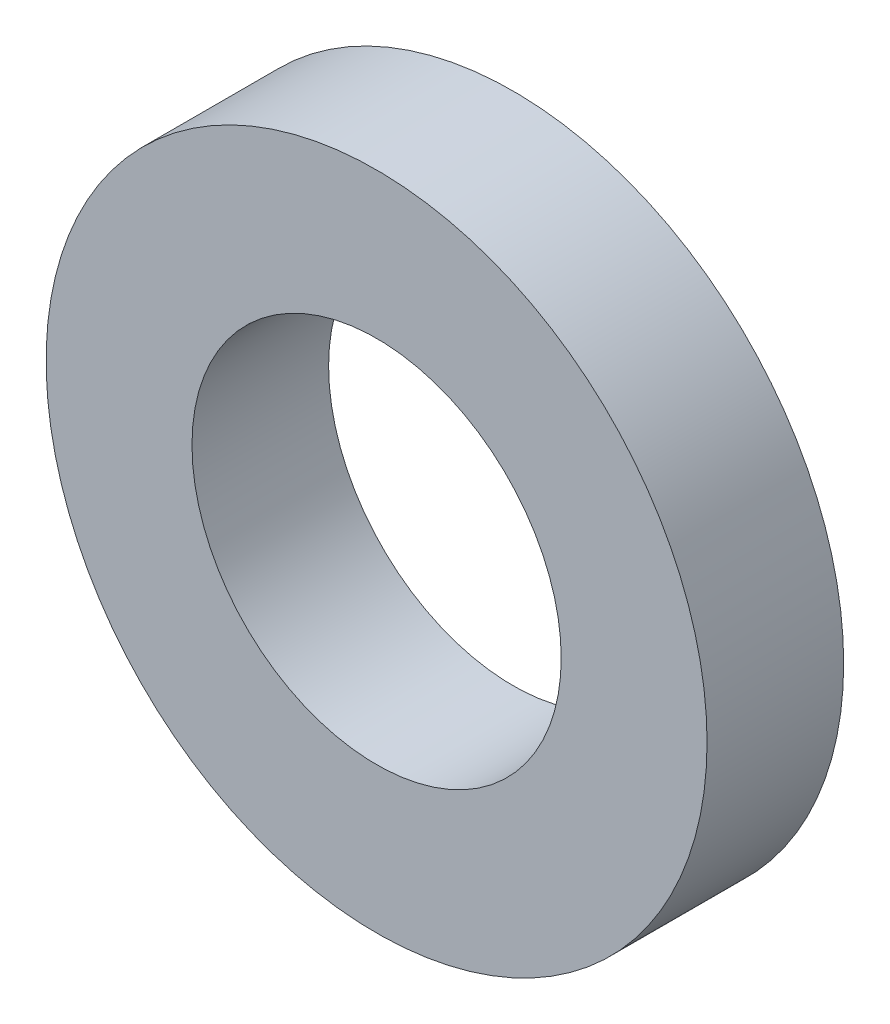
ISO-10303-21;
HEADER;
FILE_DESCRIPTION(('STEP AP214'),'2;1');
FILE_NAME('part.step','',(''),(''),'','','');
FILE_SCHEMA(('AUTOMOTIVE_DESIGN { 1 0 10303 214 1 1 1 1 }'));
ENDSEC;
DATA;
#1=APPLICATION_CONTEXT('core data for automotive mechanical design processes');
#2=APPLICATION_PROTOCOL_DEFINITION('international standard','automotive_design',2000,#1);
#3=PRODUCT_CONTEXT('',#1,'mechanical');
#4=PRODUCT('Part','Part','',(#3));
#5=PRODUCT_RELATED_PRODUCT_CATEGORY('part','',(#4));
#6=PRODUCT_DEFINITION_FORMATION('','',#4);
#7=PRODUCT_DEFINITION_CONTEXT('part definition',#1,'design');
#8=PRODUCT_DEFINITION('design','',#6,#7);
#9=PRODUCT_DEFINITION_SHAPE('','',#8);
#10=(LENGTH_UNIT() NAMED_UNIT(*) SI_UNIT(.MILLI.,.METRE.));
#11=(NAMED_UNIT(*) PLANE_ANGLE_UNIT() SI_UNIT($,.RADIAN.));
#12=(NAMED_UNIT(*) SI_UNIT($,.STERADIAN.) SOLID_ANGLE_UNIT());
#13=UNCERTAINTY_MEASURE_WITH_UNIT(LENGTH_MEASURE(1.E-05),#10,'distance_accuracy_value','');
#14=(GEOMETRIC_REPRESENTATION_CONTEXT(3) GLOBAL_UNCERTAINTY_ASSIGNED_CONTEXT((#13)) GLOBAL_UNIT_ASSIGNED_CONTEXT((#10,
#11,#12)) REPRESENTATION_CONTEXT('',''));
#15=CARTESIAN_POINT('',(0.,0.,0.));
#16=DIRECTION('',(0.,0.,1.));
#17=DIRECTION('',(1.,0.,0.));
#18=AXIS2_PLACEMENT_3D('',#15,#16,#17);
#19=CARTESIAN_POINT('',(0.,0.,3.7));
#20=DIRECTION('',(0.,0.,1.));
#21=DIRECTION('',(1.,0.,0.));
#22=AXIS2_PLACEMENT_3D('',#19,#20,#21);
#23=PLANE('',#22);
#24=CARTESIAN_POINT('',(0.,0.,3.7));
#25=DIRECTION('',(0.,0.,1.));
#26=DIRECTION('',(1.,0.,0.));
#27=AXIS2_PLACEMENT_3D('',#24,#25,#26);
#28=CIRCLE('',#27,8.95);
#29=CARTESIAN_POINT('',(8.95,0.,3.7));
#30=VERTEX_POINT('',#29);
#31=EDGE_CURVE('E10',#30,#30,#28,.T.);
#32=ORIENTED_EDGE('',*,*,#31,.T.);
#33=EDGE_LOOP('',(#32));
#34=FACE_BOUND('',#33,.T.);
#35=CARTESIAN_POINT('',(0.,0.,3.7));
#36=DIRECTION('',(0.,0.,1.));
#37=DIRECTION('',(1.,0.,0.));
#38=AXIS2_PLACEMENT_3D('',#35,#36,#37);
#39=CIRCLE('',#38,5.);
#40=CARTESIAN_POINT('',(5.,0.,3.7));
#41=VERTEX_POINT('',#40);
#42=EDGE_CURVE('E56',#41,#41,#39,.T.);
#43=ORIENTED_EDGE('',*,*,#42,.F.);
#44=EDGE_LOOP('',(#43));
#45=FACE_BOUND('',#44,.T.);
#46=ADVANCED_FACE('F43',(#34,#45),#23,.T.);
#47=CARTESIAN_POINT('',(0.,0.,0.));
#48=DIRECTION('',(0.,0.,1.));
#49=DIRECTION('',(1.,0.,0.));
#50=AXIS2_PLACEMENT_3D('',#47,#48,#49);
#51=PLANE('',#50);
#52=CARTESIAN_POINT('',(0.,0.,0.));
#53=DIRECTION('',(0.,0.,1.));
#54=DIRECTION('',(1.,0.,0.));
#55=AXIS2_PLACEMENT_3D('',#52,#53,#54);
#56=CIRCLE('',#55,8.95);
#57=CARTESIAN_POINT('',(8.95,0.,0.));
#58=VERTEX_POINT('',#57);
#59=EDGE_CURVE('E47',#58,#58,#56,.T.);
#60=ORIENTED_EDGE('',*,*,#59,.F.);
#61=EDGE_LOOP('',(#60));
#62=FACE_BOUND('',#61,.T.);
#63=CARTESIAN_POINT('',(0.,0.,0.));
#64=DIRECTION('',(0.,0.,1.));
#65=DIRECTION('',(1.,0.,0.));
#66=AXIS2_PLACEMENT_3D('',#63,#64,#65);
#67=CIRCLE('',#66,5.);
#68=CARTESIAN_POINT('',(5.,0.,0.));
#69=VERTEX_POINT('',#68);
#70=EDGE_CURVE('E58',#69,#69,#67,.T.);
#71=ORIENTED_EDGE('',*,*,#70,.T.);
#72=EDGE_LOOP('',(#71));
#73=FACE_BOUND('',#72,.T.);
#74=ADVANCED_FACE('F70',(#62,#73),#51,.F.);
#75=CARTESIAN_POINT('',(0.,0.,3.7));
#76=DIRECTION('',(0.,0.,-1.));
#77=DIRECTION('',(-1.,0.,0.));
#78=AXIS2_PLACEMENT_3D('',#75,#76,#77);
#79=CYLINDRICAL_SURFACE('',#78,8.95);
#80=ORIENTED_EDGE('',*,*,#31,.F.);
#81=EDGE_LOOP('',(#80));
#82=FACE_BOUND('',#81,.T.);
#83=ORIENTED_EDGE('',*,*,#59,.T.);
#84=EDGE_LOOP('',(#83));
#85=FACE_BOUND('',#84,.T.);
#86=ADVANCED_FACE('F45',(#82,#85),#79,.T.);
#87=CARTESIAN_POINT('',(0.,0.,3.7));
#88=DIRECTION('',(0.,0.,-1.));
#89=DIRECTION('',(-1.,0.,0.));
#90=AXIS2_PLACEMENT_3D('',#87,#88,#89);
#91=CYLINDRICAL_SURFACE('',#90,5.);
#92=ORIENTED_EDGE('',*,*,#42,.T.);
#93=EDGE_LOOP('',(#92));
#94=FACE_BOUND('',#93,.T.);
#95=ORIENTED_EDGE('',*,*,#70,.F.);
#96=EDGE_LOOP('',(#95));
#97=FACE_BOUND('',#96,.T.);
#98=ADVANCED_FACE('F66',(#94,#97),#91,.F.);
#99=CLOSED_SHELL('',(#46,#74,#86,#98));
#100=MANIFOLD_SOLID_BREP('B2',#99);
#101=ADVANCED_BREP_SHAPE_REPRESENTATION('',(#18,#100),#14);
#102=SHAPE_DEFINITION_REPRESENTATION(#9,#101);
ENDSEC;
END-ISO-10303-21;
